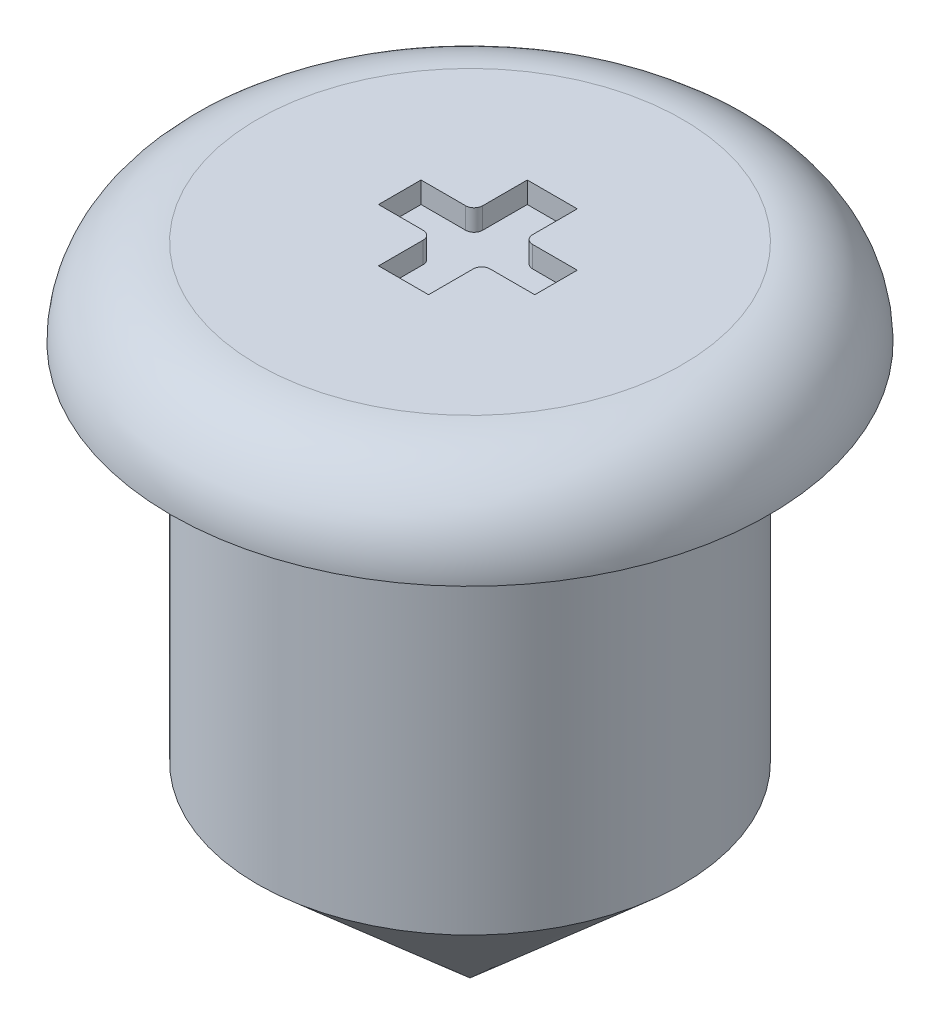
ISO-10303-21;
HEADER;
FILE_DESCRIPTION(('STEP AP214'),'2;1');
FILE_NAME('part.step','',(''),(''),'','','');
FILE_SCHEMA(('AUTOMOTIVE_DESIGN { 1 0 10303 214 1 1 1 1 }'));
ENDSEC;
DATA;
#1=APPLICATION_CONTEXT('core data for automotive mechanical design processes');
#2=APPLICATION_PROTOCOL_DEFINITION('international standard','automotive_design',2000,#1);
#3=PRODUCT_CONTEXT('',#1,'mechanical');
#4=PRODUCT('Part','Part','',(#3));
#5=PRODUCT_RELATED_PRODUCT_CATEGORY('part','',(#4));
#6=PRODUCT_DEFINITION_FORMATION('','',#4);
#7=PRODUCT_DEFINITION_CONTEXT('part definition',#1,'design');
#8=PRODUCT_DEFINITION('design','',#6,#7);
#9=PRODUCT_DEFINITION_SHAPE('','',#8);
#10=(LENGTH_UNIT() NAMED_UNIT(*) SI_UNIT(.MILLI.,.METRE.));
#11=(NAMED_UNIT(*) PLANE_ANGLE_UNIT() SI_UNIT($,.RADIAN.));
#12=(NAMED_UNIT(*) SI_UNIT($,.STERADIAN.) SOLID_ANGLE_UNIT());
#13=UNCERTAINTY_MEASURE_WITH_UNIT(LENGTH_MEASURE(1.E-05),#10,'distance_accuracy_value','');
#14=(GEOMETRIC_REPRESENTATION_CONTEXT(3) GLOBAL_UNCERTAINTY_ASSIGNED_CONTEXT((#13)) GLOBAL_UNIT_ASSIGNED_CONTEXT((#10,
#11,#12)) REPRESENTATION_CONTEXT('',''));
#15=CARTESIAN_POINT('',(0.,0.,0.));
#16=DIRECTION('',(0.,0.,1.));
#17=DIRECTION('',(1.,0.,0.));
#18=AXIS2_PLACEMENT_3D('',#15,#16,#17);
#19=CARTESIAN_POINT('',(0.,-15.8999296053397,0.));
#20=DIRECTION('',(0.,1.,0.));
#21=DIRECTION('',(0.,0.,1.));
#22=AXIS2_PLACEMENT_3D('',#19,#20,#21);
#23=CONICAL_SURFACE('',#22,0.,0.848129261083657);
#24=CARTESIAN_POINT('',(0.,-15.018131929424,0.));
#25=DIRECTION('',(0.,1.,0.));
#26=DIRECTION('',(0.,0.,1.));
#27=AXIS2_PLACEMENT_3D('',#24,#25,#26);
#28=CIRCLE('',#27,1.);
#29=CARTESIAN_POINT('',(0.,-15.018131929424,1.));
#30=VERTEX_POINT('',#29);
#31=EDGE_CURVE('E11',#30,#30,#28,.T.);
#32=ORIENTED_EDGE('',*,*,#31,.F.);
#33=EDGE_LOOP('',(#32));
#34=FACE_BOUND('',#33,.T.);
#35=CARTESIAN_POINT('',(0.,-15.8999296053397,0.));
#36=VERTEX_POINT('',#35);
#37=VERTEX_LOOP('',#36);
#38=FACE_BOUND('',#37,.T.);
#39=ADVANCED_FACE('F44',(#34,#38),#23,.T.);
#40=CARTESIAN_POINT('',(0.,-12.8999296053397,0.));
#41=DIRECTION('',(0.,1.,0.));
#42=DIRECTION('',(0.,0.,1.));
#43=AXIS2_PLACEMENT_3D('',#40,#41,#42);
#44=CYLINDRICAL_SURFACE('',#43,1.);
#45=CARTESIAN_POINT('',(0.,-13.3080014136376,0.));
#46=DIRECTION('',(0.,1.,0.));
#47=DIRECTION('',(0.,0.,1.));
#48=AXIS2_PLACEMENT_3D('',#45,#46,#47);
#49=CIRCLE('',#48,1.);
#50=CARTESIAN_POINT('',(0.,-13.3080014136376,1.));
#51=VERTEX_POINT('',#50);
#52=EDGE_CURVE('E51',#51,#51,#49,.T.);
#53=ORIENTED_EDGE('',*,*,#52,.F.);
#54=EDGE_LOOP('',(#53));
#55=FACE_BOUND('',#54,.T.);
#56=ORIENTED_EDGE('',*,*,#31,.T.);
#57=EDGE_LOOP('',(#56));
#58=FACE_BOUND('',#57,.T.);
#59=ADVANCED_FACE('F300',(#55,#58),#44,.T.);
#60=CARTESIAN_POINT('',(1.40807180829788,-13.3080014136376,0.));
#61=DIRECTION('',(0.,1.,0.));
#62=DIRECTION('',(0.,0.,1.));
#63=AXIS2_PLACEMENT_3D('',#60,#61,#62);
#64=PLANE('',#63);
#65=CARTESIAN_POINT('',(0.,-13.3080014136376,0.));
#66=DIRECTION('',(0.,1.,0.));
#67=DIRECTION('',(0.,0.,1.));
#68=AXIS2_PLACEMENT_3D('',#65,#66,#67);
#69=CIRCLE('',#68,1.40807180829788);
#70=CARTESIAN_POINT('',(0.,-13.3080014136376,1.40807180829788));
#71=VERTEX_POINT('',#70);
#72=EDGE_CURVE('E293',#71,#71,#69,.T.);
#73=ORIENTED_EDGE('',*,*,#72,.F.);
#74=EDGE_LOOP('',(#73));
#75=FACE_BOUND('',#74,.T.);
#76=ORIENTED_EDGE('',*,*,#52,.T.);
#77=EDGE_LOOP('',(#76));
#78=FACE_BOUND('',#77,.T.);
#79=ADVANCED_FACE('F298',(#75,#78),#64,.F.);
#80=CARTESIAN_POINT('',(0.,-13.3080014136376,0.));
#81=DIRECTION('',(0.,1.,0.));
#82=DIRECTION('',(0.,0.,1.));
#83=AXIS2_PLACEMENT_3D('',#80,#81,#82);
#84=TOROIDAL_SURFACE('',#83,1.,0.408071808297883);
#85=CARTESIAN_POINT('',(0.,-12.8999296053397,0.));
#86=DIRECTION('',(0.,1.,0.));
#87=DIRECTION('',(0.,0.,1.));
#88=AXIS2_PLACEMENT_3D('',#85,#86,#87);
#89=CIRCLE('',#88,1.);
#90=CARTESIAN_POINT('',(0.,-12.8999296053397,1.));
#91=VERTEX_POINT('',#90);
#92=EDGE_CURVE('E263',#91,#91,#89,.T.);
#93=ORIENTED_EDGE('',*,*,#92,.F.);
#94=EDGE_LOOP('',(#93));
#95=FACE_BOUND('',#94,.T.);
#96=ORIENTED_EDGE('',*,*,#72,.T.);
#97=EDGE_LOOP('',(#96));
#98=FACE_BOUND('',#97,.T.);
#99=ADVANCED_FACE('F319',(#95,#98),#84,.T.);
#100=CARTESIAN_POINT('',(1.,-12.8999296053397,0.));
#101=DIRECTION('',(0.,-1.,0.));
#102=DIRECTION('',(0.,0.,-1.));
#103=AXIS2_PLACEMENT_3D('',#100,#101,#102);
#104=PLANE('',#103);
#105=DIRECTION('',(-1.,0.,0.));
#106=VECTOR('',#105,1.);
#107=CARTESIAN_POINT('',(-0.117632759443697,-12.8999296053397,-0.387224573028196));
#108=LINE('',#107,#106);
#109=CARTESIAN_POINT('',(0.117632759443697,-12.8999296053397,-0.387224573028196));
#110=VERTEX_POINT('',#109);
#111=CARTESIAN_POINT('',(-0.117632759443697,-12.8999296053397,-0.387224573028196));
#112=VERTEX_POINT('',#111);
#113=EDGE_CURVE('E221',#110,#112,#108,.T.);
#114=ORIENTED_EDGE('',*,*,#113,.F.);
#115=DIRECTION('',(0.,0.,-1.));
#116=VECTOR('',#115,1.);
#117=CARTESIAN_POINT('',(0.117632759443697,-12.8999296053397,-0.387224573028196));
#118=LINE('',#117,#116);
#119=CARTESIAN_POINT('',(0.117632759443697,-12.8999296053397,-0.177224573028196));
#120=VERTEX_POINT('',#119);
#121=EDGE_CURVE('E58',#120,#110,#118,.T.);
#122=ORIENTED_EDGE('',*,*,#121,.F.);
#123=CARTESIAN_POINT('',(0.157632759443697,-12.8999296053397,-0.177224573028196));
#124=DIRECTION('',(0.,-1.,0.));
#125=DIRECTION('',(0.,0.,1.));
#126=AXIS2_PLACEMENT_3D('',#123,#124,#125);
#127=CIRCLE('',#126,0.04);
#128=CARTESIAN_POINT('',(0.157632759443697,-12.8999296053397,-0.137224573028196));
#129=VERTEX_POINT('',#128);
#130=EDGE_CURVE('E177',#129,#120,#127,.T.);
#131=ORIENTED_EDGE('',*,*,#130,.F.);
#132=DIRECTION('',(-1.,0.,0.));
#133=VECTOR('',#132,1.);
#134=CARTESIAN_POINT('',(0.157632759443697,-12.8999296053397,-0.137224573028196));
#135=LINE('',#134,#133);
#136=CARTESIAN_POINT('',(0.367632759443697,-12.8999296053397,-0.137224573028196));
#137=VERTEX_POINT('',#136);
#138=EDGE_CURVE('E180',#137,#129,#135,.T.);
#139=ORIENTED_EDGE('',*,*,#138,.F.);
#140=DIRECTION('',(0.,0.,-1.));
#141=VECTOR('',#140,1.);
#142=CARTESIAN_POINT('',(0.367632759443697,-12.8999296053397,-0.137224573028196));
#143=LINE('',#142,#141);
#144=CARTESIAN_POINT('',(0.367632759443697,-12.8999296053397,0.0627754269718038));
#145=VERTEX_POINT('',#144);
#146=EDGE_CURVE('E256',#145,#137,#143,.T.);
#147=ORIENTED_EDGE('',*,*,#146,.F.);
#148=DIRECTION('',(1.,0.,0.));
#149=VECTOR('',#148,1.);
#150=CARTESIAN_POINT('',(0.367632759443697,-12.8999296053397,0.0627754269718038));
#151=LINE('',#150,#149);
#152=CARTESIAN_POINT('',(0.157632759443697,-12.8999296053397,0.0627754269718039));
#153=VERTEX_POINT('',#152);
#154=EDGE_CURVE('E253',#153,#145,#151,.T.);
#155=ORIENTED_EDGE('',*,*,#154,.F.);
#156=CARTESIAN_POINT('',(0.157632759443697,-12.8999296053397,0.102775426971804));
#157=DIRECTION('',(0.,-1.,0.));
#158=DIRECTION('',(0.,0.,1.));
#159=AXIS2_PLACEMENT_3D('',#156,#157,#158);
#160=CIRCLE('',#159,0.04);
#161=CARTESIAN_POINT('',(0.117632759443697,-12.8999296053397,0.102775426971804));
#162=VERTEX_POINT('',#161);
#163=EDGE_CURVE('E250',#162,#153,#160,.T.);
#164=ORIENTED_EDGE('',*,*,#163,.F.);
#165=DIRECTION('',(0.,0.,-1.));
#166=VECTOR('',#165,1.);
#167=CARTESIAN_POINT('',(0.117632759443697,-12.8999296053397,0.102775426971804));
#168=LINE('',#167,#166);
#169=CARTESIAN_POINT('',(0.117632759443697,-12.8999296053397,0.312775426971804));
#170=VERTEX_POINT('',#169);
#171=EDGE_CURVE('E247',#170,#162,#168,.T.);
#172=ORIENTED_EDGE('',*,*,#171,.F.);
#173=DIRECTION('',(1.,0.,0.));
#174=VECTOR('',#173,1.);
#175=CARTESIAN_POINT('',(0.117632759443697,-12.8999296053397,0.312775426971804));
#176=LINE('',#175,#174);
#177=CARTESIAN_POINT('',(-0.117632759443697,-12.8999296053397,0.312775426971804));
#178=VERTEX_POINT('',#177);
#179=EDGE_CURVE('E244',#178,#170,#176,.T.);
#180=ORIENTED_EDGE('',*,*,#179,.F.);
#181=DIRECTION('',(0.,0.,1.));
#182=VECTOR('',#181,1.);
#183=CARTESIAN_POINT('',(-0.117632759443697,-12.8999296053397,0.102775426971804));
#184=LINE('',#183,#182);
#185=CARTESIAN_POINT('',(-0.117632759443697,-12.8999296053397,0.102775426971804));
#186=VERTEX_POINT('',#185);
#187=EDGE_CURVE('E241',#186,#178,#184,.T.);
#188=ORIENTED_EDGE('',*,*,#187,.F.);
#189=CARTESIAN_POINT('',(-0.157632759443697,-12.8999296053397,0.102775426971804));
#190=DIRECTION('',(0.,-1.,0.));
#191=DIRECTION('',(0.,0.,-1.));
#192=AXIS2_PLACEMENT_3D('',#189,#190,#191);
#193=CIRCLE('',#192,0.04);
#194=CARTESIAN_POINT('',(-0.157632759443697,-12.8999296053397,0.0627754269718039));
#195=VERTEX_POINT('',#194);
#196=EDGE_CURVE('E238',#195,#186,#193,.T.);
#197=ORIENTED_EDGE('',*,*,#196,.F.);
#198=DIRECTION('',(1.,0.,0.));
#199=VECTOR('',#198,1.);
#200=CARTESIAN_POINT('',(-0.367632759443697,-12.8999296053397,0.0627754269718039));
#201=LINE('',#200,#199);
#202=CARTESIAN_POINT('',(-0.367632759443697,-12.8999296053397,0.0627754269718039));
#203=VERTEX_POINT('',#202);
#204=EDGE_CURVE('E235',#203,#195,#201,.T.);
#205=ORIENTED_EDGE('',*,*,#204,.F.);
#206=DIRECTION('',(0.,0.,1.));
#207=VECTOR('',#206,1.);
#208=CARTESIAN_POINT('',(-0.367632759443697,-12.8999296053397,-0.137224573028196));
#209=LINE('',#208,#207);
#210=CARTESIAN_POINT('',(-0.367632759443697,-12.8999296053397,-0.137224573028196));
#211=VERTEX_POINT('',#210);
#212=EDGE_CURVE('E232',#211,#203,#209,.T.);
#213=ORIENTED_EDGE('',*,*,#212,.F.);
#214=DIRECTION('',(-1.,0.,0.));
#215=VECTOR('',#214,1.);
#216=CARTESIAN_POINT('',(-0.157632759443697,-12.8999296053397,-0.137224573028196));
#217=LINE('',#216,#215);
#218=CARTESIAN_POINT('',(-0.157632759443697,-12.8999296053397,-0.137224573028196));
#219=VERTEX_POINT('',#218);
#220=EDGE_CURVE('E229',#219,#211,#217,.T.);
#221=ORIENTED_EDGE('',*,*,#220,.F.);
#222=CARTESIAN_POINT('',(-0.157632759443697,-12.8999296053397,-0.177224573028196));
#223=DIRECTION('',(0.,-1.,0.));
#224=DIRECTION('',(0.,0.,-1.));
#225=AXIS2_PLACEMENT_3D('',#222,#223,#224);
#226=CIRCLE('',#225,0.04);
#227=CARTESIAN_POINT('',(-0.117632759443697,-12.8999296053397,-0.177224573028196));
#228=VERTEX_POINT('',#227);
#229=EDGE_CURVE('E226',#228,#219,#226,.T.);
#230=ORIENTED_EDGE('',*,*,#229,.F.);
#231=DIRECTION('',(0.,0.,1.));
#232=VECTOR('',#231,1.);
#233=CARTESIAN_POINT('',(-0.117632759443697,-12.8999296053397,-0.387224573028196));
#234=LINE('',#233,#232);
#235=EDGE_CURVE('E223',#112,#228,#234,.T.);
#236=ORIENTED_EDGE('',*,*,#235,.F.);
#237=EDGE_LOOP('',(#114,#122,#131,#139,#147,#155,#164,#172,#180,#188,#197,#205,#213,#221,#230,#236));
#238=FACE_BOUND('',#237,.T.);
#239=ORIENTED_EDGE('',*,*,#92,.T.);
#240=EDGE_LOOP('',(#239));
#241=FACE_BOUND('',#240,.T.);
#242=ADVANCED_FACE('F328',(#238,#241),#104,.F.);
#243=CARTESIAN_POINT('',(0.117632759443697,-12.9999296053397,-0.387224573028196));
#244=DIRECTION('',(1.,0.,0.));
#245=DIRECTION('',(0.,0.,-1.));
#246=AXIS2_PLACEMENT_3D('',#243,#244,#245);
#247=PLANE('',#246);
#248=ORIENTED_EDGE('',*,*,#121,.T.);
#249=DIRECTION('',(0.,1.,0.));
#250=VECTOR('',#249,1.);
#251=CARTESIAN_POINT('',(0.117632759443697,-12.9999296053397,-0.387224573028196));
#252=LINE('',#251,#250);
#253=CARTESIAN_POINT('',(0.117632759443697,-12.9999296053397,-0.387224573028196));
#254=VERTEX_POINT('',#253);
#255=EDGE_CURVE('E154',#254,#110,#252,.T.);
#256=ORIENTED_EDGE('',*,*,#255,.F.);
#257=DIRECTION('',(0.,0.,-1.));
#258=VECTOR('',#257,1.);
#259=CARTESIAN_POINT('',(0.117632759443697,-12.9999296053397,-0.387224573028196));
#260=LINE('',#259,#258);
#261=CARTESIAN_POINT('',(0.117632759443697,-12.9999296053397,-0.177224573028196));
#262=VERTEX_POINT('',#261);
#263=EDGE_CURVE('E158',#262,#254,#260,.T.);
#264=ORIENTED_EDGE('',*,*,#263,.F.);
#265=DIRECTION('',(0.,1.,0.));
#266=VECTOR('',#265,1.);
#267=CARTESIAN_POINT('',(0.117632759443697,-12.9999296053397,-0.177224573028196));
#268=LINE('',#267,#266);
#269=EDGE_CURVE('E261',#262,#120,#268,.T.);
#270=ORIENTED_EDGE('',*,*,#269,.T.);
#271=EDGE_LOOP('',(#248,#256,#264,#270));
#272=FACE_BOUND('',#271,.T.);
#273=ADVANCED_FACE('F156',(#272),#247,.F.);
#274=CARTESIAN_POINT('',(0.157632759443697,-12.9999296053397,-0.177224573028196));
#275=DIRECTION('',(0.,1.,0.));
#276=DIRECTION('',(0.,0.,1.));
#277=AXIS2_PLACEMENT_3D('',#274,#275,#276);
#278=CYLINDRICAL_SURFACE('',#277,0.04);
#279=ORIENTED_EDGE('',*,*,#130,.T.);
#280=ORIENTED_EDGE('',*,*,#269,.F.);
#281=CARTESIAN_POINT('',(0.157632759443697,-12.9999296053397,-0.177224573028196));
#282=DIRECTION('',(0.,-1.,0.));
#283=DIRECTION('',(0.,0.,1.));
#284=AXIS2_PLACEMENT_3D('',#281,#282,#283);
#285=CIRCLE('',#284,0.04);
#286=CARTESIAN_POINT('',(0.157632759443697,-12.9999296053397,-0.137224573028196));
#287=VERTEX_POINT('',#286);
#288=EDGE_CURVE('E164',#287,#262,#285,.T.);
#289=ORIENTED_EDGE('',*,*,#288,.F.);
#290=DIRECTION('',(0.,1.,0.));
#291=VECTOR('',#290,1.);
#292=CARTESIAN_POINT('',(0.157632759443697,-12.9999296053397,-0.137224573028196));
#293=LINE('',#292,#291);
#294=EDGE_CURVE('E264',#287,#129,#293,.T.);
#295=ORIENTED_EDGE('',*,*,#294,.T.);
#296=EDGE_LOOP('',(#279,#280,#289,#295));
#297=FACE_BOUND('',#296,.T.);
#298=ADVANCED_FACE('F343',(#297),#278,.T.);
#299=CARTESIAN_POINT('',(0.157632759443697,-12.9999296053397,-0.137224573028196));
#300=DIRECTION('',(0.,0.,-1.));
#301=DIRECTION('',(-1.,0.,0.));
#302=AXIS2_PLACEMENT_3D('',#299,#300,#301);
#303=PLANE('',#302);
#304=ORIENTED_EDGE('',*,*,#138,.T.);
#305=ORIENTED_EDGE('',*,*,#294,.F.);
#306=DIRECTION('',(-1.,0.,0.));
#307=VECTOR('',#306,1.);
#308=CARTESIAN_POINT('',(0.157632759443697,-12.9999296053397,-0.137224573028196));
#309=LINE('',#308,#307);
#310=CARTESIAN_POINT('',(0.367632759443697,-12.9999296053397,-0.137224573028196));
#311=VERTEX_POINT('',#310);
#312=EDGE_CURVE('E217',#311,#287,#309,.T.);
#313=ORIENTED_EDGE('',*,*,#312,.F.);
#314=DIRECTION('',(0.,1.,0.));
#315=VECTOR('',#314,1.);
#316=CARTESIAN_POINT('',(0.367632759443697,-12.9999296053397,-0.137224573028196));
#317=LINE('',#316,#315);
#318=EDGE_CURVE('E266',#311,#137,#317,.T.);
#319=ORIENTED_EDGE('',*,*,#318,.T.);
#320=EDGE_LOOP('',(#304,#305,#313,#319));
#321=FACE_BOUND('',#320,.T.);
#322=ADVANCED_FACE('F350',(#321),#303,.F.);
#323=CARTESIAN_POINT('',(0.367632759443697,-12.9999296053397,-0.137224573028196));
#324=DIRECTION('',(1.,0.,0.));
#325=DIRECTION('',(0.,0.,-1.));
#326=AXIS2_PLACEMENT_3D('',#323,#324,#325);
#327=PLANE('',#326);
#328=ORIENTED_EDGE('',*,*,#146,.T.);
#329=ORIENTED_EDGE('',*,*,#318,.F.);
#330=DIRECTION('',(0.,0.,-1.));
#331=VECTOR('',#330,1.);
#332=CARTESIAN_POINT('',(0.367632759443697,-12.9999296053397,-0.137224573028196));
#333=LINE('',#332,#331);
#334=CARTESIAN_POINT('',(0.367632759443697,-12.9999296053397,0.0627754269718038));
#335=VERTEX_POINT('',#334);
#336=EDGE_CURVE('E214',#335,#311,#333,.T.);
#337=ORIENTED_EDGE('',*,*,#336,.F.);
#338=DIRECTION('',(0.,1.,0.));
#339=VECTOR('',#338,1.);
#340=CARTESIAN_POINT('',(0.367632759443697,-12.9999296053397,0.0627754269718038));
#341=LINE('',#340,#339);
#342=EDGE_CURVE('E268',#335,#145,#341,.T.);
#343=ORIENTED_EDGE('',*,*,#342,.T.);
#344=EDGE_LOOP('',(#328,#329,#337,#343));
#345=FACE_BOUND('',#344,.T.);
#346=ADVANCED_FACE('F358',(#345),#327,.F.);
#347=CARTESIAN_POINT('',(0.367632759443697,-12.9999296053397,0.0627754269718038));
#348=DIRECTION('',(0.,0.,1.));
#349=DIRECTION('',(1.,0.,0.));
#350=AXIS2_PLACEMENT_3D('',#347,#348,#349);
#351=PLANE('',#350);
#352=ORIENTED_EDGE('',*,*,#154,.T.);
#353=ORIENTED_EDGE('',*,*,#342,.F.);
#354=DIRECTION('',(1.,0.,0.));
#355=VECTOR('',#354,1.);
#356=CARTESIAN_POINT('',(0.367632759443697,-12.9999296053397,0.0627754269718038));
#357=LINE('',#356,#355);
#358=CARTESIAN_POINT('',(0.157632759443697,-12.9999296053397,0.0627754269718039));
#359=VERTEX_POINT('',#358);
#360=EDGE_CURVE('E211',#359,#335,#357,.T.);
#361=ORIENTED_EDGE('',*,*,#360,.F.);
#362=DIRECTION('',(0.,1.,0.));
#363=VECTOR('',#362,1.);
#364=CARTESIAN_POINT('',(0.157632759443697,-12.9999296053397,0.0627754269718039));
#365=LINE('',#364,#363);
#366=EDGE_CURVE('E270',#359,#153,#365,.T.);
#367=ORIENTED_EDGE('',*,*,#366,.T.);
#368=EDGE_LOOP('',(#352,#353,#361,#367));
#369=FACE_BOUND('',#368,.T.);
#370=ADVANCED_FACE('F366',(#369),#351,.F.);
#371=CARTESIAN_POINT('',(0.157632759443697,-12.9999296053397,0.102775426971804));
#372=DIRECTION('',(0.,1.,0.));
#373=DIRECTION('',(0.,0.,1.));
#374=AXIS2_PLACEMENT_3D('',#371,#372,#373);
#375=CYLINDRICAL_SURFACE('',#374,0.04);
#376=ORIENTED_EDGE('',*,*,#163,.T.);
#377=ORIENTED_EDGE('',*,*,#366,.F.);
#378=CARTESIAN_POINT('',(0.157632759443697,-12.9999296053397,0.102775426971804));
#379=DIRECTION('',(0.,-1.,0.));
#380=DIRECTION('',(0.,0.,1.));
#381=AXIS2_PLACEMENT_3D('',#378,#379,#380);
#382=CIRCLE('',#381,0.04);
#383=CARTESIAN_POINT('',(0.117632759443697,-12.9999296053397,0.102775426971804));
#384=VERTEX_POINT('',#383);
#385=EDGE_CURVE('E208',#384,#359,#382,.T.);
#386=ORIENTED_EDGE('',*,*,#385,.F.);
#387=DIRECTION('',(0.,1.,0.));
#388=VECTOR('',#387,1.);
#389=CARTESIAN_POINT('',(0.117632759443697,-12.9999296053397,0.102775426971804));
#390=LINE('',#389,#388);
#391=EDGE_CURVE('E272',#384,#162,#390,.T.);
#392=ORIENTED_EDGE('',*,*,#391,.T.);
#393=EDGE_LOOP('',(#376,#377,#386,#392));
#394=FACE_BOUND('',#393,.T.);
#395=ADVANCED_FACE('F374',(#394),#375,.T.);
#396=CARTESIAN_POINT('',(0.117632759443697,-12.9999296053397,0.102775426971804));
#397=DIRECTION('',(1.,0.,0.));
#398=DIRECTION('',(0.,0.,-1.));
#399=AXIS2_PLACEMENT_3D('',#396,#397,#398);
#400=PLANE('',#399);
#401=ORIENTED_EDGE('',*,*,#171,.T.);
#402=ORIENTED_EDGE('',*,*,#391,.F.);
#403=DIRECTION('',(0.,0.,-1.));
#404=VECTOR('',#403,1.);
#405=CARTESIAN_POINT('',(0.117632759443697,-12.9999296053397,0.102775426971804));
#406=LINE('',#405,#404);
#407=CARTESIAN_POINT('',(0.117632759443697,-12.9999296053397,0.312775426971804));
#408=VERTEX_POINT('',#407);
#409=EDGE_CURVE('E205',#408,#384,#406,.T.);
#410=ORIENTED_EDGE('',*,*,#409,.F.);
#411=DIRECTION('',(0.,1.,0.));
#412=VECTOR('',#411,1.);
#413=CARTESIAN_POINT('',(0.117632759443697,-12.9999296053397,0.312775426971804));
#414=LINE('',#413,#412);
#415=EDGE_CURVE('E274',#408,#170,#414,.T.);
#416=ORIENTED_EDGE('',*,*,#415,.T.);
#417=EDGE_LOOP('',(#401,#402,#410,#416));
#418=FACE_BOUND('',#417,.T.);
#419=ADVANCED_FACE('F382',(#418),#400,.F.);
#420=CARTESIAN_POINT('',(0.117632759443697,-12.9999296053397,0.312775426971804));
#421=DIRECTION('',(0.,0.,1.));
#422=DIRECTION('',(1.,0.,0.));
#423=AXIS2_PLACEMENT_3D('',#420,#421,#422);
#424=PLANE('',#423);
#425=ORIENTED_EDGE('',*,*,#179,.T.);
#426=ORIENTED_EDGE('',*,*,#415,.F.);
#427=DIRECTION('',(1.,0.,0.));
#428=VECTOR('',#427,1.);
#429=CARTESIAN_POINT('',(0.117632759443697,-12.9999296053397,0.312775426971804));
#430=LINE('',#429,#428);
#431=CARTESIAN_POINT('',(-0.117632759443697,-12.9999296053397,0.312775426971804));
#432=VERTEX_POINT('',#431);
#433=EDGE_CURVE('E202',#432,#408,#430,.T.);
#434=ORIENTED_EDGE('',*,*,#433,.F.);
#435=DIRECTION('',(0.,1.,0.));
#436=VECTOR('',#435,1.);
#437=CARTESIAN_POINT('',(-0.117632759443697,-12.9999296053397,0.312775426971804));
#438=LINE('',#437,#436);
#439=EDGE_CURVE('E276',#432,#178,#438,.T.);
#440=ORIENTED_EDGE('',*,*,#439,.T.);
#441=EDGE_LOOP('',(#425,#426,#434,#440));
#442=FACE_BOUND('',#441,.T.);
#443=ADVANCED_FACE('F390',(#442),#424,.F.);
#444=CARTESIAN_POINT('',(-0.117632759443697,-12.9999296053397,0.102775426971804));
#445=DIRECTION('',(-1.,0.,0.));
#446=DIRECTION('',(0.,0.,1.));
#447=AXIS2_PLACEMENT_3D('',#444,#445,#446);
#448=PLANE('',#447);
#449=ORIENTED_EDGE('',*,*,#187,.T.);
#450=ORIENTED_EDGE('',*,*,#439,.F.);
#451=DIRECTION('',(0.,0.,1.));
#452=VECTOR('',#451,1.);
#453=CARTESIAN_POINT('',(-0.117632759443697,-12.9999296053397,0.102775426971804));
#454=LINE('',#453,#452);
#455=CARTESIAN_POINT('',(-0.117632759443697,-12.9999296053397,0.102775426971804));
#456=VERTEX_POINT('',#455);
#457=EDGE_CURVE('E199',#456,#432,#454,.T.);
#458=ORIENTED_EDGE('',*,*,#457,.F.);
#459=DIRECTION('',(0.,1.,0.));
#460=VECTOR('',#459,1.);
#461=CARTESIAN_POINT('',(-0.117632759443697,-12.9999296053397,0.102775426971804));
#462=LINE('',#461,#460);
#463=EDGE_CURVE('E278',#456,#186,#462,.T.);
#464=ORIENTED_EDGE('',*,*,#463,.T.);
#465=EDGE_LOOP('',(#449,#450,#458,#464));
#466=FACE_BOUND('',#465,.T.);
#467=ADVANCED_FACE('F398',(#466),#448,.F.);
#468=CARTESIAN_POINT('',(-0.157632759443697,-12.9999296053397,0.102775426971804));
#469=DIRECTION('',(0.,1.,0.));
#470=DIRECTION('',(0.,0.,1.));
#471=AXIS2_PLACEMENT_3D('',#468,#469,#470);
#472=CYLINDRICAL_SURFACE('',#471,0.04);
#473=ORIENTED_EDGE('',*,*,#196,.T.);
#474=ORIENTED_EDGE('',*,*,#463,.F.);
#475=CARTESIAN_POINT('',(-0.157632759443697,-12.9999296053397,0.102775426971804));
#476=DIRECTION('',(0.,-1.,0.));
#477=DIRECTION('',(0.,0.,-1.));
#478=AXIS2_PLACEMENT_3D('',#475,#476,#477);
#479=CIRCLE('',#478,0.04);
#480=CARTESIAN_POINT('',(-0.157632759443697,-12.9999296053397,0.0627754269718039));
#481=VERTEX_POINT('',#480);
#482=EDGE_CURVE('E196',#481,#456,#479,.T.);
#483=ORIENTED_EDGE('',*,*,#482,.F.);
#484=DIRECTION('',(0.,1.,0.));
#485=VECTOR('',#484,1.);
#486=CARTESIAN_POINT('',(-0.157632759443697,-12.9999296053397,0.0627754269718039));
#487=LINE('',#486,#485);
#488=EDGE_CURVE('E280',#481,#195,#487,.T.);
#489=ORIENTED_EDGE('',*,*,#488,.T.);
#490=EDGE_LOOP('',(#473,#474,#483,#489));
#491=FACE_BOUND('',#490,.T.);
#492=ADVANCED_FACE('F406',(#491),#472,.T.);
#493=CARTESIAN_POINT('',(-0.367632759443697,-12.9999296053397,0.0627754269718039));
#494=DIRECTION('',(0.,0.,1.));
#495=DIRECTION('',(1.,0.,0.));
#496=AXIS2_PLACEMENT_3D('',#493,#494,#495);
#497=PLANE('',#496);
#498=ORIENTED_EDGE('',*,*,#204,.T.);
#499=ORIENTED_EDGE('',*,*,#488,.F.);
#500=DIRECTION('',(1.,0.,0.));
#501=VECTOR('',#500,1.);
#502=CARTESIAN_POINT('',(-0.367632759443697,-12.9999296053397,0.0627754269718039));
#503=LINE('',#502,#501);
#504=CARTESIAN_POINT('',(-0.367632759443697,-12.9999296053397,0.0627754269718039));
#505=VERTEX_POINT('',#504);
#506=EDGE_CURVE('E193',#505,#481,#503,.T.);
#507=ORIENTED_EDGE('',*,*,#506,.F.);
#508=DIRECTION('',(0.,1.,0.));
#509=VECTOR('',#508,1.);
#510=CARTESIAN_POINT('',(-0.367632759443697,-12.9999296053397,0.0627754269718039));
#511=LINE('',#510,#509);
#512=EDGE_CURVE('E282',#505,#203,#511,.T.);
#513=ORIENTED_EDGE('',*,*,#512,.T.);
#514=EDGE_LOOP('',(#498,#499,#507,#513));
#515=FACE_BOUND('',#514,.T.);
#516=ADVANCED_FACE('F414',(#515),#497,.F.);
#517=CARTESIAN_POINT('',(-0.367632759443697,-12.9999296053397,-0.137224573028196));
#518=DIRECTION('',(-1.,0.,0.));
#519=DIRECTION('',(0.,0.,1.));
#520=AXIS2_PLACEMENT_3D('',#517,#518,#519);
#521=PLANE('',#520);
#522=ORIENTED_EDGE('',*,*,#212,.T.);
#523=ORIENTED_EDGE('',*,*,#512,.F.);
#524=DIRECTION('',(0.,0.,1.));
#525=VECTOR('',#524,1.);
#526=CARTESIAN_POINT('',(-0.367632759443697,-12.9999296053397,-0.137224573028196));
#527=LINE('',#526,#525);
#528=CARTESIAN_POINT('',(-0.367632759443697,-12.9999296053397,-0.137224573028196));
#529=VERTEX_POINT('',#528);
#530=EDGE_CURVE('E190',#529,#505,#527,.T.);
#531=ORIENTED_EDGE('',*,*,#530,.F.);
#532=DIRECTION('',(0.,1.,0.));
#533=VECTOR('',#532,1.);
#534=CARTESIAN_POINT('',(-0.367632759443697,-12.9999296053397,-0.137224573028196));
#535=LINE('',#534,#533);
#536=EDGE_CURVE('E284',#529,#211,#535,.T.);
#537=ORIENTED_EDGE('',*,*,#536,.T.);
#538=EDGE_LOOP('',(#522,#523,#531,#537));
#539=FACE_BOUND('',#538,.T.);
#540=ADVANCED_FACE('F422',(#539),#521,.F.);
#541=CARTESIAN_POINT('',(-0.157632759443697,-12.9999296053397,-0.137224573028196));
#542=DIRECTION('',(0.,0.,-1.));
#543=DIRECTION('',(-1.,0.,0.));
#544=AXIS2_PLACEMENT_3D('',#541,#542,#543);
#545=PLANE('',#544);
#546=ORIENTED_EDGE('',*,*,#220,.T.);
#547=ORIENTED_EDGE('',*,*,#536,.F.);
#548=DIRECTION('',(-1.,0.,0.));
#549=VECTOR('',#548,1.);
#550=CARTESIAN_POINT('',(-0.157632759443697,-12.9999296053397,-0.137224573028196));
#551=LINE('',#550,#549);
#552=CARTESIAN_POINT('',(-0.157632759443697,-12.9999296053397,-0.137224573028196));
#553=VERTEX_POINT('',#552);
#554=EDGE_CURVE('E187',#553,#529,#551,.T.);
#555=ORIENTED_EDGE('',*,*,#554,.F.);
#556=DIRECTION('',(0.,1.,0.));
#557=VECTOR('',#556,1.);
#558=CARTESIAN_POINT('',(-0.157632759443697,-12.9999296053397,-0.137224573028196));
#559=LINE('',#558,#557);
#560=EDGE_CURVE('E286',#553,#219,#559,.T.);
#561=ORIENTED_EDGE('',*,*,#560,.T.);
#562=EDGE_LOOP('',(#546,#547,#555,#561));
#563=FACE_BOUND('',#562,.T.);
#564=ADVANCED_FACE('F430',(#563),#545,.F.);
#565=CARTESIAN_POINT('',(-0.157632759443697,-12.9999296053397,-0.177224573028196));
#566=DIRECTION('',(0.,1.,0.));
#567=DIRECTION('',(0.,0.,1.));
#568=AXIS2_PLACEMENT_3D('',#565,#566,#567);
#569=CYLINDRICAL_SURFACE('',#568,0.04);
#570=ORIENTED_EDGE('',*,*,#229,.T.);
#571=ORIENTED_EDGE('',*,*,#560,.F.);
#572=CARTESIAN_POINT('',(-0.157632759443697,-12.9999296053397,-0.177224573028196));
#573=DIRECTION('',(0.,-1.,0.));
#574=DIRECTION('',(0.,0.,-1.));
#575=AXIS2_PLACEMENT_3D('',#572,#573,#574);
#576=CIRCLE('',#575,0.04);
#577=CARTESIAN_POINT('',(-0.117632759443697,-12.9999296053397,-0.177224573028196));
#578=VERTEX_POINT('',#577);
#579=EDGE_CURVE('E184',#578,#553,#576,.T.);
#580=ORIENTED_EDGE('',*,*,#579,.F.);
#581=DIRECTION('',(0.,1.,0.));
#582=VECTOR('',#581,1.);
#583=CARTESIAN_POINT('',(-0.117632759443697,-12.9999296053397,-0.177224573028196));
#584=LINE('',#583,#582);
#585=EDGE_CURVE('E288',#578,#228,#584,.T.);
#586=ORIENTED_EDGE('',*,*,#585,.T.);
#587=EDGE_LOOP('',(#570,#571,#580,#586));
#588=FACE_BOUND('',#587,.T.);
#589=ADVANCED_FACE('F438',(#588),#569,.T.);
#590=CARTESIAN_POINT('',(-0.117632759443697,-12.9999296053397,-0.387224573028196));
#591=DIRECTION('',(-1.,0.,0.));
#592=DIRECTION('',(0.,0.,1.));
#593=AXIS2_PLACEMENT_3D('',#590,#591,#592);
#594=PLANE('',#593);
#595=ORIENTED_EDGE('',*,*,#235,.T.);
#596=ORIENTED_EDGE('',*,*,#585,.F.);
#597=DIRECTION('',(0.,0.,1.));
#598=VECTOR('',#597,1.);
#599=CARTESIAN_POINT('',(-0.117632759443697,-12.9999296053397,-0.387224573028196));
#600=LINE('',#599,#598);
#601=CARTESIAN_POINT('',(-0.117632759443697,-12.9999296053397,-0.387224573028196));
#602=VERTEX_POINT('',#601);
#603=EDGE_CURVE('E172',#602,#578,#600,.T.);
#604=ORIENTED_EDGE('',*,*,#603,.F.);
#605=DIRECTION('',(0.,1.,0.));
#606=VECTOR('',#605,1.);
#607=CARTESIAN_POINT('',(-0.117632759443697,-12.9999296053397,-0.387224573028196));
#608=LINE('',#607,#606);
#609=EDGE_CURVE('E163',#602,#112,#608,.T.);
#610=ORIENTED_EDGE('',*,*,#609,.T.);
#611=EDGE_LOOP('',(#595,#596,#604,#610));
#612=FACE_BOUND('',#611,.T.);
#613=ADVANCED_FACE('F446',(#612),#594,.F.);
#614=CARTESIAN_POINT('',(-0.117632759443697,-12.9999296053397,-0.387224573028196));
#615=DIRECTION('',(0.,0.,-1.));
#616=DIRECTION('',(-1.,0.,0.));
#617=AXIS2_PLACEMENT_3D('',#614,#615,#616);
#618=PLANE('',#617);
#619=ORIENTED_EDGE('',*,*,#113,.T.);
#620=ORIENTED_EDGE('',*,*,#609,.F.);
#621=DIRECTION('',(-1.,0.,0.));
#622=VECTOR('',#621,1.);
#623=CARTESIAN_POINT('',(-0.117632759443697,-12.9999296053397,-0.387224573028196));
#624=LINE('',#623,#622);
#625=EDGE_CURVE('E167',#254,#602,#624,.T.);
#626=ORIENTED_EDGE('',*,*,#625,.F.);
#627=ORIENTED_EDGE('',*,*,#255,.T.);
#628=EDGE_LOOP('',(#619,#620,#626,#627));
#629=FACE_BOUND('',#628,.T.);
#630=ADVANCED_FACE('F168',(#629),#618,.F.);
#631=CARTESIAN_POINT('',(0.157632759443697,-12.9999296053397,-0.177224573028196));
#632=DIRECTION('',(0.,1.,0.));
#633=DIRECTION('',(0.,0.,1.));
#634=AXIS2_PLACEMENT_3D('',#631,#632,#633);
#635=PLANE('',#634);
#636=ORIENTED_EDGE('',*,*,#263,.T.);
#637=ORIENTED_EDGE('',*,*,#625,.T.);
#638=ORIENTED_EDGE('',*,*,#603,.T.);
#639=ORIENTED_EDGE('',*,*,#579,.T.);
#640=ORIENTED_EDGE('',*,*,#554,.T.);
#641=ORIENTED_EDGE('',*,*,#530,.T.);
#642=ORIENTED_EDGE('',*,*,#506,.T.);
#643=ORIENTED_EDGE('',*,*,#482,.T.);
#644=ORIENTED_EDGE('',*,*,#457,.T.);
#645=ORIENTED_EDGE('',*,*,#433,.T.);
#646=ORIENTED_EDGE('',*,*,#409,.T.);
#647=ORIENTED_EDGE('',*,*,#385,.T.);
#648=ORIENTED_EDGE('',*,*,#360,.T.);
#649=ORIENTED_EDGE('',*,*,#336,.T.);
#650=ORIENTED_EDGE('',*,*,#312,.T.);
#651=ORIENTED_EDGE('',*,*,#288,.T.);
#652=EDGE_LOOP('',(#636,#637,#638,#639,#640,#641,#642,#643,#644,#645,#646,#647,#648,#649,#650,#651));
#653=FACE_BOUND('',#652,.T.);
#654=ADVANCED_FACE('F174',(#653),#635,.T.);
#655=CLOSED_SHELL('',(#39,#59,#79,#99,#242,#273,#298,#322,#346,#370,#395,#419,#443,#467,#492,
#516,#540,#564,#589,#613,#630,#654));
#656=MANIFOLD_SOLID_BREP('B2',#655);
#657=ADVANCED_BREP_SHAPE_REPRESENTATION('',(#18,#656),#14);
#658=SHAPE_DEFINITION_REPRESENTATION(#9,#657);
ENDSEC;
END-ISO-10303-21;
